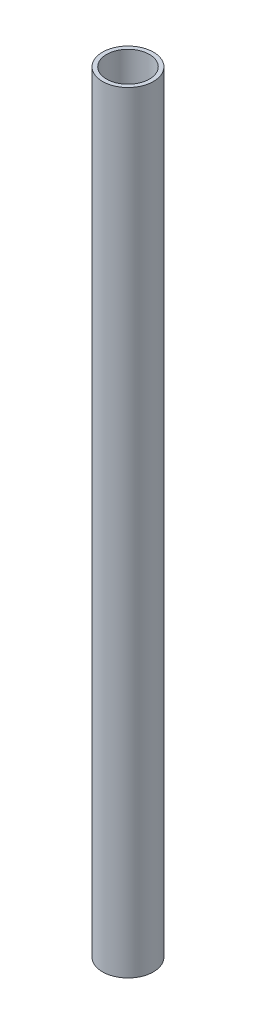
ISO-10303-21;
HEADER;
FILE_DESCRIPTION(('STEP AP214'),'2;1');
FILE_NAME('part.step','',(''),(''),'','','');
FILE_SCHEMA(('AUTOMOTIVE_DESIGN { 1 0 10303 214 1 1 1 1 }'));
ENDSEC;
DATA;
#1=APPLICATION_CONTEXT('core data for automotive mechanical design processes');
#2=APPLICATION_PROTOCOL_DEFINITION('international standard','automotive_design',2000,#1);
#3=PRODUCT_CONTEXT('',#1,'mechanical');
#4=PRODUCT('Part','Part','',(#3));
#5=PRODUCT_RELATED_PRODUCT_CATEGORY('part','',(#4));
#6=PRODUCT_DEFINITION_FORMATION('','',#4);
#7=PRODUCT_DEFINITION_CONTEXT('part definition',#1,'design');
#8=PRODUCT_DEFINITION('design','',#6,#7);
#9=PRODUCT_DEFINITION_SHAPE('','',#8);
#10=(LENGTH_UNIT() NAMED_UNIT(*) SI_UNIT(.MILLI.,.METRE.));
#11=(NAMED_UNIT(*) PLANE_ANGLE_UNIT() SI_UNIT($,.RADIAN.));
#12=(NAMED_UNIT(*) SI_UNIT($,.STERADIAN.) SOLID_ANGLE_UNIT());
#13=UNCERTAINTY_MEASURE_WITH_UNIT(LENGTH_MEASURE(1.E-05),#10,'distance_accuracy_value','');
#14=(GEOMETRIC_REPRESENTATION_CONTEXT(3) GLOBAL_UNCERTAINTY_ASSIGNED_CONTEXT((#13)) GLOBAL_UNIT_ASSIGNED_CONTEXT((#10,
#11,#12)) REPRESENTATION_CONTEXT('',''));
#15=CARTESIAN_POINT('',(0.,0.,0.));
#16=DIRECTION('',(0.,0.,1.));
#17=DIRECTION('',(1.,0.,0.));
#18=AXIS2_PLACEMENT_3D('',#15,#16,#17);
#19=CARTESIAN_POINT('',(0.,914.4,0.));
#20=DIRECTION('',(0.,1.,0.));
#21=DIRECTION('',(0.,0.,1.));
#22=AXIS2_PLACEMENT_3D('',#19,#20,#21);
#23=PLANE('',#22);
#24=CARTESIAN_POINT('',(0.,914.4,0.));
#25=DIRECTION('',(0.,1.,0.));
#26=DIRECTION('',(0.,0.,1.));
#27=AXIS2_PLACEMENT_3D('',#24,#25,#26);
#28=CIRCLE('',#27,30.1625);
#29=CARTESIAN_POINT('',(0.,914.4,30.1625));
#30=VERTEX_POINT('',#29);
#31=EDGE_CURVE('E10',#30,#30,#28,.T.);
#32=ORIENTED_EDGE('',*,*,#31,.T.);
#33=EDGE_LOOP('',(#32));
#34=FACE_BOUND('',#33,.T.);
#35=CARTESIAN_POINT('',(0.,914.4,0.));
#36=DIRECTION('',(0.,1.,0.));
#37=DIRECTION('',(0.,0.,1.));
#38=AXIS2_PLACEMENT_3D('',#35,#36,#37);
#39=CIRCLE('',#38,25.4);
#40=CARTESIAN_POINT('',(0.,914.4,25.4));
#41=VERTEX_POINT('',#40);
#42=EDGE_CURVE('E50',#41,#41,#39,.T.);
#43=ORIENTED_EDGE('',*,*,#42,.F.);
#44=EDGE_LOOP('',(#43));
#45=FACE_BOUND('',#44,.T.);
#46=ADVANCED_FACE('F37',(#34,#45),#23,.T.);
#47=CARTESIAN_POINT('',(0.,0.,0.));
#48=DIRECTION('',(0.,1.,0.));
#49=DIRECTION('',(0.,0.,1.));
#50=AXIS2_PLACEMENT_3D('',#47,#48,#49);
#51=PLANE('',#50);
#52=CARTESIAN_POINT('',(0.,0.,0.));
#53=DIRECTION('',(0.,1.,0.));
#54=DIRECTION('',(0.,0.,1.));
#55=AXIS2_PLACEMENT_3D('',#52,#53,#54);
#56=CIRCLE('',#55,30.1625);
#57=CARTESIAN_POINT('',(0.,0.,30.1625));
#58=VERTEX_POINT('',#57);
#59=EDGE_CURVE('E41',#58,#58,#56,.T.);
#60=ORIENTED_EDGE('',*,*,#59,.F.);
#61=EDGE_LOOP('',(#60));
#62=FACE_BOUND('',#61,.T.);
#63=CARTESIAN_POINT('',(0.,0.,0.));
#64=DIRECTION('',(0.,1.,0.));
#65=DIRECTION('',(0.,0.,1.));
#66=AXIS2_PLACEMENT_3D('',#63,#64,#65);
#67=CIRCLE('',#66,25.4);
#68=CARTESIAN_POINT('',(0.,0.,25.4));
#69=VERTEX_POINT('',#68);
#70=EDGE_CURVE('E52',#69,#69,#67,.T.);
#71=ORIENTED_EDGE('',*,*,#70,.T.);
#72=EDGE_LOOP('',(#71));
#73=FACE_BOUND('',#72,.T.);
#74=ADVANCED_FACE('F64',(#62,#73),#51,.F.);
#75=CARTESIAN_POINT('',(0.,914.4,0.));
#76=DIRECTION('',(0.,-1.,0.));
#77=DIRECTION('',(0.,0.,-1.));
#78=AXIS2_PLACEMENT_3D('',#75,#76,#77);
#79=CYLINDRICAL_SURFACE('',#78,30.1625);
#80=ORIENTED_EDGE('',*,*,#31,.F.);
#81=EDGE_LOOP('',(#80));
#82=FACE_BOUND('',#81,.T.);
#83=ORIENTED_EDGE('',*,*,#59,.T.);
#84=EDGE_LOOP('',(#83));
#85=FACE_BOUND('',#84,.T.);
#86=ADVANCED_FACE('F39',(#82,#85),#79,.T.);
#87=CARTESIAN_POINT('',(0.,914.4,0.));
#88=DIRECTION('',(0.,-1.,0.));
#89=DIRECTION('',(0.,0.,-1.));
#90=AXIS2_PLACEMENT_3D('',#87,#88,#89);
#91=CYLINDRICAL_SURFACE('',#90,25.4);
#92=ORIENTED_EDGE('',*,*,#42,.T.);
#93=EDGE_LOOP('',(#92));
#94=FACE_BOUND('',#93,.T.);
#95=ORIENTED_EDGE('',*,*,#70,.F.);
#96=EDGE_LOOP('',(#95));
#97=FACE_BOUND('',#96,.T.);
#98=ADVANCED_FACE('F60',(#94,#97),#91,.F.);
#99=CLOSED_SHELL('',(#46,#74,#86,#98));
#100=MANIFOLD_SOLID_BREP('B2',#99);
#101=ADVANCED_BREP_SHAPE_REPRESENTATION('',(#18,#100),#14);
#102=SHAPE_DEFINITION_REPRESENTATION(#9,#101);
ENDSEC;
END-ISO-10303-21;
